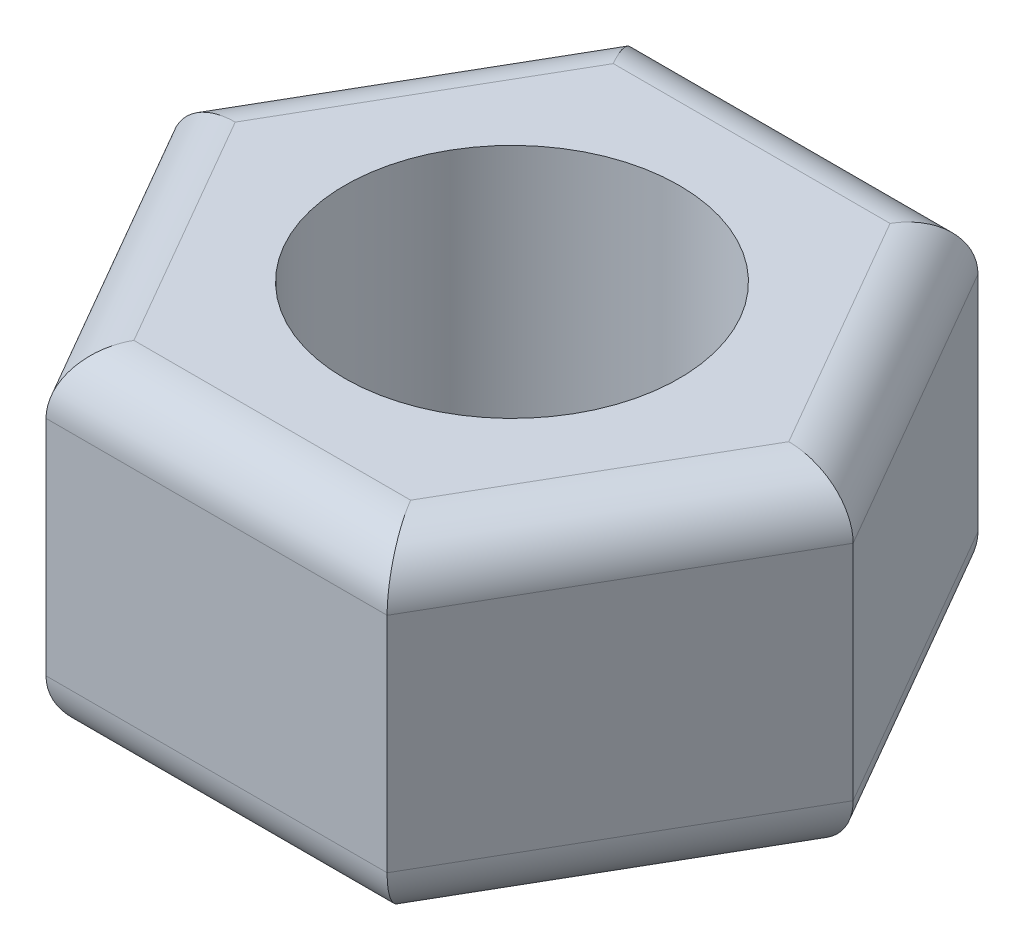
ISO-10303-21;
HEADER;
FILE_DESCRIPTION(('STEP AP214'),'2;1');
FILE_NAME('part.step','',(''),(''),'','','');
FILE_SCHEMA(('AUTOMOTIVE_DESIGN { 1 0 10303 214 1 1 1 1 }'));
ENDSEC;
DATA;
#1=APPLICATION_CONTEXT('core data for automotive mechanical design processes');
#2=APPLICATION_PROTOCOL_DEFINITION('international standard','automotive_design',2000,#1);
#3=PRODUCT_CONTEXT('',#1,'mechanical');
#4=PRODUCT('Part','Part','',(#3));
#5=PRODUCT_RELATED_PRODUCT_CATEGORY('part','',(#4));
#6=PRODUCT_DEFINITION_FORMATION('','',#4);
#7=PRODUCT_DEFINITION_CONTEXT('part definition',#1,'design');
#8=PRODUCT_DEFINITION('design','',#6,#7);
#9=PRODUCT_DEFINITION_SHAPE('','',#8);
#10=(LENGTH_UNIT() NAMED_UNIT(*) SI_UNIT(.MILLI.,.METRE.));
#11=(NAMED_UNIT(*) PLANE_ANGLE_UNIT() SI_UNIT($,.RADIAN.));
#12=(NAMED_UNIT(*) SI_UNIT($,.STERADIAN.) SOLID_ANGLE_UNIT());
#13=UNCERTAINTY_MEASURE_WITH_UNIT(LENGTH_MEASURE(1.E-05),#10,'distance_accuracy_value','');
#14=(GEOMETRIC_REPRESENTATION_CONTEXT(3) GLOBAL_UNCERTAINTY_ASSIGNED_CONTEXT((#13)) GLOBAL_UNIT_ASSIGNED_CONTEXT((#10,
#11,#12)) REPRESENTATION_CONTEXT('',''));
#15=CARTESIAN_POINT('',(0.,0.,0.));
#16=DIRECTION('',(0.,0.,1.));
#17=DIRECTION('',(1.,0.,0.));
#18=AXIS2_PLACEMENT_3D('',#15,#16,#17);
#19=CARTESIAN_POINT('',(1.52997821335252,3.,2.64999999999999));
#20=DIRECTION('',(-0.866025403784438,0.,-0.500000000000001));
#21=DIRECTION('',(-0.500000000000001,0.,0.866025403784438));
#22=AXIS2_PLACEMENT_3D('',#19,#20,#21);
#23=PLANE('',#22);
#24=DIRECTION('',(0.,-1.,0.));
#25=VECTOR('',#24,1.);
#26=CARTESIAN_POINT('',(1.52997821335252,3.,2.64999999999999));
#27=LINE('',#26,#25);
#28=CARTESIAN_POINT('',(1.52997821335252,2.5,2.64999999999999));
#29=VERTEX_POINT('',#28);
#30=CARTESIAN_POINT('',(1.52997821335252,0.5,2.64999999999999));
#31=VERTEX_POINT('',#30);
#32=EDGE_CURVE('E242',#29,#31,#27,.T.);
#33=ORIENTED_EDGE('',*,*,#32,.T.);
#34=DIRECTION('',(0.500000000000001,0.,-0.866025403784438));
#35=VECTOR('',#34,1.);
#36=CARTESIAN_POINT('',(1.52997821335252,0.5,2.64999999999999));
#37=LINE('',#36,#35);
#38=CARTESIAN_POINT('',(3.05995642670501,0.5,0.));
#39=VERTEX_POINT('',#38);
#40=EDGE_CURVE('E187',#31,#39,#37,.T.);
#41=ORIENTED_EDGE('',*,*,#40,.T.);
#42=DIRECTION('',(0.,-1.,0.));
#43=VECTOR('',#42,1.);
#44=CARTESIAN_POINT('',(3.05995642670501,3.,0.));
#45=LINE('',#44,#43);
#46=CARTESIAN_POINT('',(3.05995642670501,2.5,0.));
#47=VERTEX_POINT('',#46);
#48=EDGE_CURVE('E160',#47,#39,#45,.T.);
#49=ORIENTED_EDGE('',*,*,#48,.F.);
#50=DIRECTION('',(0.500000000000001,0.,-0.866025403784438));
#51=VECTOR('',#50,1.);
#52=CARTESIAN_POINT('',(1.52997821335252,2.5,2.64999999999999));
#53=LINE('',#52,#51);
#54=EDGE_CURVE('E185',#47,#29,#53,.F.);
#55=ORIENTED_EDGE('',*,*,#54,.T.);
#56=EDGE_LOOP('',(#33,#41,#49,#55));
#57=FACE_BOUND('',#56,.T.);
#58=ADVANCED_FACE('F35',(#57),#23,.F.);
#59=CARTESIAN_POINT('',(3.05995642670501,3.,0.));
#60=DIRECTION('',(-0.866025403784439,0.,0.499999999999999));
#61=DIRECTION('',(0.499999999999999,0.,0.866025403784439));
#62=AXIS2_PLACEMENT_3D('',#59,#60,#61);
#63=PLANE('',#62);
#64=ORIENTED_EDGE('',*,*,#48,.T.);
#65=DIRECTION('',(-0.499999999999999,0.,-0.866025403784439));
#66=VECTOR('',#65,1.);
#67=CARTESIAN_POINT('',(3.05995642670501,0.5,0.));
#68=LINE('',#67,#66);
#69=CARTESIAN_POINT('',(1.52997821335249,0.5,-2.65));
#70=VERTEX_POINT('',#69);
#71=EDGE_CURVE('E191',#39,#70,#68,.T.);
#72=ORIENTED_EDGE('',*,*,#71,.T.);
#73=DIRECTION('',(0.,-1.,0.));
#74=VECTOR('',#73,1.);
#75=CARTESIAN_POINT('',(1.52997821335249,3.,-2.65));
#76=LINE('',#75,#74);
#77=CARTESIAN_POINT('',(1.52997821335249,2.5,-2.65));
#78=VERTEX_POINT('',#77);
#79=EDGE_CURVE('E165',#78,#70,#76,.T.);
#80=ORIENTED_EDGE('',*,*,#79,.F.);
#81=DIRECTION('',(-0.499999999999999,0.,-0.866025403784439));
#82=VECTOR('',#81,1.);
#83=CARTESIAN_POINT('',(3.05995642670501,2.5,0.));
#84=LINE('',#83,#82);
#85=EDGE_CURVE('E189',#78,#47,#84,.F.);
#86=ORIENTED_EDGE('',*,*,#85,.T.);
#87=EDGE_LOOP('',(#64,#72,#80,#86));
#88=FACE_BOUND('',#87,.T.);
#89=ADVANCED_FACE('F285',(#88),#63,.F.);
#90=CARTESIAN_POINT('',(1.52997821335249,3.,-2.65));
#91=DIRECTION('',(0.,0.,1.));
#92=DIRECTION('',(1.,0.,0.));
#93=AXIS2_PLACEMENT_3D('',#90,#91,#92);
#94=PLANE('',#93);
#95=ORIENTED_EDGE('',*,*,#79,.T.);
#96=DIRECTION('',(-1.,0.,0.));
#97=VECTOR('',#96,1.);
#98=CARTESIAN_POINT('',(1.52997821335249,0.5,-2.65));
#99=LINE('',#98,#97);
#100=CARTESIAN_POINT('',(-1.52997821335251,0.5,-2.65));
#101=VERTEX_POINT('',#100);
#102=EDGE_CURVE('E196',#70,#101,#99,.T.);
#103=ORIENTED_EDGE('',*,*,#102,.T.);
#104=DIRECTION('',(0.,-1.,0.));
#105=VECTOR('',#104,1.);
#106=CARTESIAN_POINT('',(-1.52997821335251,3.,-2.65));
#107=LINE('',#106,#105);
#108=CARTESIAN_POINT('',(-1.52997821335251,2.5,-2.65));
#109=VERTEX_POINT('',#108);
#110=EDGE_CURVE('E149',#109,#101,#107,.T.);
#111=ORIENTED_EDGE('',*,*,#110,.F.);
#112=DIRECTION('',(-1.,0.,0.));
#113=VECTOR('',#112,1.);
#114=CARTESIAN_POINT('',(1.52997821335249,2.5,-2.65));
#115=LINE('',#114,#113);
#116=EDGE_CURVE('E193',#109,#78,#115,.F.);
#117=ORIENTED_EDGE('',*,*,#116,.T.);
#118=EDGE_LOOP('',(#95,#103,#111,#117));
#119=FACE_BOUND('',#118,.T.);
#120=ADVANCED_FACE('F256',(#119),#94,.F.);
#121=CARTESIAN_POINT('',(-1.52997821335251,3.,-2.65));
#122=DIRECTION('',(0.866025403784438,0.,0.500000000000001));
#123=DIRECTION('',(0.500000000000001,0.,-0.866025403784438));
#124=AXIS2_PLACEMENT_3D('',#121,#122,#123);
#125=PLANE('',#124);
#126=ORIENTED_EDGE('',*,*,#110,.T.);
#127=DIRECTION('',(-0.500000000000001,0.,0.866025403784438));
#128=VECTOR('',#127,1.);
#129=CARTESIAN_POINT('',(-1.52997821335251,0.5,-2.65));
#130=LINE('',#129,#128);
#131=CARTESIAN_POINT('',(-3.05995642670502,0.5,0.));
#132=VERTEX_POINT('',#131);
#133=EDGE_CURVE('E148',#101,#132,#130,.T.);
#134=ORIENTED_EDGE('',*,*,#133,.T.);
#135=DIRECTION('',(0.,-1.,0.));
#136=VECTOR('',#135,1.);
#137=CARTESIAN_POINT('',(-3.05995642670502,3.,0.));
#138=LINE('',#137,#136);
#139=CARTESIAN_POINT('',(-3.05995642670502,2.5,0.));
#140=VERTEX_POINT('',#139);
#141=EDGE_CURVE('E130',#140,#132,#138,.T.);
#142=ORIENTED_EDGE('',*,*,#141,.F.);
#143=DIRECTION('',(-0.500000000000001,0.,0.866025403784438));
#144=VECTOR('',#143,1.);
#145=CARTESIAN_POINT('',(-1.52997821335251,2.5,-2.65));
#146=LINE('',#145,#144);
#147=EDGE_CURVE('E145',#140,#109,#146,.F.);
#148=ORIENTED_EDGE('',*,*,#147,.T.);
#149=EDGE_LOOP('',(#126,#134,#142,#148));
#150=FACE_BOUND('',#149,.T.);
#151=ADVANCED_FACE('F143',(#150),#125,.F.);
#152=CARTESIAN_POINT('',(-3.05995642670502,3.,0.));
#153=DIRECTION('',(0.866025403784438,0.,-0.5));
#154=DIRECTION('',(-0.5,0.,-0.866025403784439));
#155=AXIS2_PLACEMENT_3D('',#152,#153,#154);
#156=PLANE('',#155);
#157=ORIENTED_EDGE('',*,*,#141,.T.);
#158=DIRECTION('',(0.5,0.,0.866025403784439));
#159=VECTOR('',#158,1.);
#160=CARTESIAN_POINT('',(-3.05995642670502,0.5,0.));
#161=LINE('',#160,#159);
#162=CARTESIAN_POINT('',(-1.52997821335251,0.5,2.65));
#163=VERTEX_POINT('',#162);
#164=EDGE_CURVE('E137',#132,#163,#161,.T.);
#165=ORIENTED_EDGE('',*,*,#164,.T.);
#166=DIRECTION('',(0.,-1.,0.));
#167=VECTOR('',#166,1.);
#168=CARTESIAN_POINT('',(-1.52997821335251,3.,2.65));
#169=LINE('',#168,#167);
#170=CARTESIAN_POINT('',(-1.52997821335251,2.5,2.65));
#171=VERTEX_POINT('',#170);
#172=EDGE_CURVE('E132',#171,#163,#169,.T.);
#173=ORIENTED_EDGE('',*,*,#172,.F.);
#174=DIRECTION('',(0.5,0.,0.866025403784439));
#175=VECTOR('',#174,1.);
#176=CARTESIAN_POINT('',(-3.05995642670503,2.5,0.));
#177=LINE('',#176,#175);
#178=EDGE_CURVE('E127',#171,#140,#177,.F.);
#179=ORIENTED_EDGE('',*,*,#178,.T.);
#180=EDGE_LOOP('',(#157,#165,#173,#179));
#181=FACE_BOUND('',#180,.T.);
#182=ADVANCED_FACE('F129',(#181),#156,.F.);
#183=CARTESIAN_POINT('',(-1.52997821335251,3.,2.65));
#184=DIRECTION('',(0.,0.,-1.));
#185=DIRECTION('',(-1.,0.,0.));
#186=AXIS2_PLACEMENT_3D('',#183,#184,#185);
#187=PLANE('',#186);
#188=ORIENTED_EDGE('',*,*,#172,.T.);
#189=DIRECTION('',(1.,0.,0.));
#190=VECTOR('',#189,1.);
#191=CARTESIAN_POINT('',(-1.52997821335251,0.5,2.65));
#192=LINE('',#191,#190);
#193=EDGE_CURVE('E183',#163,#31,#192,.T.);
#194=ORIENTED_EDGE('',*,*,#193,.T.);
#195=ORIENTED_EDGE('',*,*,#32,.F.);
#196=DIRECTION('',(1.,0.,0.));
#197=VECTOR('',#196,1.);
#198=CARTESIAN_POINT('',(-1.52997821335251,2.5,2.65));
#199=LINE('',#198,#197);
#200=EDGE_CURVE('E181',#29,#171,#199,.F.);
#201=ORIENTED_EDGE('',*,*,#200,.T.);
#202=EDGE_LOOP('',(#188,#194,#195,#201));
#203=FACE_BOUND('',#202,.T.);
#204=ADVANCED_FACE('F239',(#203),#187,.F.);
#205=CARTESIAN_POINT('',(0.,3.,0.));
#206=DIRECTION('',(0.,1.,0.));
#207=DIRECTION('',(0.,0.,1.));
#208=AXIS2_PLACEMENT_3D('',#205,#206,#207);
#209=PLANE('',#208);
#210=DIRECTION('',(-0.499999999999999,0.,-0.866025403784439));
#211=VECTOR('',#210,1.);
#212=CARTESIAN_POINT('',(1.09696551146027,3.,-2.4));
#213=LINE('',#212,#211);
#214=CARTESIAN_POINT('',(2.48260615751538,3.,0.));
#215=VERTEX_POINT('',#214);
#216=CARTESIAN_POINT('',(1.24130307875767,3.,-2.15));
#217=VERTEX_POINT('',#216);
#218=EDGE_CURVE('E198',#215,#217,#213,.T.);
#219=ORIENTED_EDGE('',*,*,#218,.T.);
#220=DIRECTION('',(-1.,0.,0.));
#221=VECTOR('',#220,1.);
#222=CARTESIAN_POINT('',(-1.52997821335251,3.,-2.15));
#223=LINE('',#222,#221);
#224=CARTESIAN_POINT('',(-1.2413030787577,3.,-2.15));
#225=VERTEX_POINT('',#224);
#226=EDGE_CURVE('E11',#217,#225,#223,.T.);
#227=ORIENTED_EDGE('',*,*,#226,.T.);
#228=DIRECTION('',(-0.500000000000001,0.,0.866025403784438));
#229=VECTOR('',#228,1.);
#230=CARTESIAN_POINT('',(-2.62694372481281,3.,0.249999999999995));
#231=LINE('',#230,#229);
#232=CARTESIAN_POINT('',(-2.4826061575154,3.,0.));
#233=VERTEX_POINT('',#232);
#234=EDGE_CURVE('E44',#225,#233,#231,.T.);
#235=ORIENTED_EDGE('',*,*,#234,.T.);
#236=DIRECTION('',(0.5,0.,0.866025403784439));
#237=VECTOR('',#236,1.);
#238=CARTESIAN_POINT('',(-1.09696551146029,3.,2.4));
#239=LINE('',#238,#237);
#240=CARTESIAN_POINT('',(-1.2413030787577,3.,2.15));
#241=VERTEX_POINT('',#240);
#242=EDGE_CURVE('E154',#233,#241,#239,.T.);
#243=ORIENTED_EDGE('',*,*,#242,.T.);
#244=DIRECTION('',(1.,0.,0.));
#245=VECTOR('',#244,1.);
#246=CARTESIAN_POINT('',(1.52997821335252,3.,2.14999999999999));
#247=LINE('',#246,#245);
#248=CARTESIAN_POINT('',(1.2413030787577,3.,2.14999999999999));
#249=VERTEX_POINT('',#248);
#250=EDGE_CURVE('E202',#241,#249,#247,.T.);
#251=ORIENTED_EDGE('',*,*,#250,.T.);
#252=DIRECTION('',(0.500000000000001,0.,-0.866025403784438));
#253=VECTOR('',#252,1.);
#254=CARTESIAN_POINT('',(2.62694372481279,3.,-0.249999999999972));
#255=LINE('',#254,#253);
#256=EDGE_CURVE('E200',#249,#215,#255,.T.);
#257=ORIENTED_EDGE('',*,*,#256,.T.);
#258=EDGE_LOOP('',(#219,#227,#235,#243,#251,#257));
#259=FACE_BOUND('',#258,.T.);
#260=CARTESIAN_POINT('',(0.,3.,0.));
#261=DIRECTION('',(0.,1.,0.));
#262=DIRECTION('',(0.,0.,1.));
#263=AXIS2_PLACEMENT_3D('',#260,#261,#262);
#264=CIRCLE('',#263,1.5);
#265=CARTESIAN_POINT('',(0.,3.,1.5));
#266=VERTEX_POINT('',#265);
#267=EDGE_CURVE('E222',#266,#266,#264,.T.);
#268=ORIENTED_EDGE('',*,*,#267,.F.);
#269=EDGE_LOOP('',(#268));
#270=FACE_BOUND('',#269,.T.);
#271=ADVANCED_FACE('F291',(#259,#270),#209,.T.);
#272=CARTESIAN_POINT('',(0.,0.,0.));
#273=DIRECTION('',(0.,1.,0.));
#274=DIRECTION('',(0.,0.,1.));
#275=AXIS2_PLACEMENT_3D('',#272,#273,#274);
#276=PLANE('',#275);
#277=DIRECTION('',(0.5,0.,0.866025403784439));
#278=VECTOR('',#277,1.);
#279=CARTESIAN_POINT('',(-1.86195461813655,0.,1.075));
#280=LINE('',#279,#278);
#281=CARTESIAN_POINT('',(-1.2413030787577,0.,2.15));
#282=VERTEX_POINT('',#281);
#283=CARTESIAN_POINT('',(-2.4826061575154,0.,0.));
#284=VERTEX_POINT('',#283);
#285=EDGE_CURVE('E176',#282,#284,#280,.F.);
#286=ORIENTED_EDGE('',*,*,#285,.T.);
#287=DIRECTION('',(-0.500000000000001,0.,0.866025403784438));
#288=VECTOR('',#287,1.);
#289=CARTESIAN_POINT('',(-1.86195461813655,0.,-1.07500000000001));
#290=LINE('',#289,#288);
#291=CARTESIAN_POINT('',(-1.2413030787577,0.,-2.15));
#292=VERTEX_POINT('',#291);
#293=EDGE_CURVE('E138',#284,#292,#290,.F.);
#294=ORIENTED_EDGE('',*,*,#293,.T.);
#295=DIRECTION('',(-1.,0.,0.));
#296=VECTOR('',#295,1.);
#297=CARTESIAN_POINT('',(0.,0.,-2.15));
#298=LINE('',#297,#296);
#299=CARTESIAN_POINT('',(1.24130307875767,0.,-2.15));
#300=VERTEX_POINT('',#299);
#301=EDGE_CURVE('E162',#292,#300,#298,.F.);
#302=ORIENTED_EDGE('',*,*,#301,.T.);
#303=DIRECTION('',(-0.499999999999999,0.,-0.866025403784439));
#304=VECTOR('',#303,1.);
#305=CARTESIAN_POINT('',(1.86195461813653,0.,-1.07499999999999));
#306=LINE('',#305,#304);
#307=CARTESIAN_POINT('',(2.48260615751538,0.,0.));
#308=VERTEX_POINT('',#307);
#309=EDGE_CURVE('E170',#300,#308,#306,.F.);
#310=ORIENTED_EDGE('',*,*,#309,.T.);
#311=DIRECTION('',(0.500000000000001,0.,-0.866025403784438));
#312=VECTOR('',#311,1.);
#313=CARTESIAN_POINT('',(1.86195461813655,0.,1.075));
#314=LINE('',#313,#312);
#315=CARTESIAN_POINT('',(1.2413030787577,0.,2.14999999999999));
#316=VERTEX_POINT('',#315);
#317=EDGE_CURVE('E172',#308,#316,#314,.F.);
#318=ORIENTED_EDGE('',*,*,#317,.T.);
#319=DIRECTION('',(1.,0.,0.));
#320=VECTOR('',#319,1.);
#321=CARTESIAN_POINT('',(0.,0.,2.15));
#322=LINE('',#321,#320);
#323=EDGE_CURVE('E174',#316,#282,#322,.F.);
#324=ORIENTED_EDGE('',*,*,#323,.T.);
#325=EDGE_LOOP('',(#286,#294,#302,#310,#318,#324));
#326=FACE_BOUND('',#325,.T.);
#327=CARTESIAN_POINT('',(0.,0.,0.));
#328=DIRECTION('',(0.,1.,0.));
#329=DIRECTION('',(0.,0.,1.));
#330=AXIS2_PLACEMENT_3D('',#327,#328,#329);
#331=CIRCLE('',#330,1.5);
#332=CARTESIAN_POINT('',(0.,0.,1.5));
#333=VERTEX_POINT('',#332);
#334=EDGE_CURVE('E245',#333,#333,#331,.T.);
#335=ORIENTED_EDGE('',*,*,#334,.T.);
#336=EDGE_LOOP('',(#335));
#337=FACE_BOUND('',#336,.T.);
#338=ADVANCED_FACE('F323',(#326,#337),#276,.F.);
#339=CARTESIAN_POINT('',(0.,0.,0.));
#340=DIRECTION('',(0.,1.,0.));
#341=DIRECTION('',(0.,0.,1.));
#342=AXIS2_PLACEMENT_3D('',#339,#340,#341);
#343=CYLINDRICAL_SURFACE('',#342,1.5);
#344=ORIENTED_EDGE('',*,*,#334,.F.);
#345=EDGE_LOOP('',(#344));
#346=FACE_BOUND('',#345,.T.);
#347=ORIENTED_EDGE('',*,*,#267,.T.);
#348=EDGE_LOOP('',(#347));
#349=FACE_BOUND('',#348,.T.);
#350=ADVANCED_FACE('F319',(#346,#349),#343,.F.);
#351=CARTESIAN_POINT('',(1.0969655114603,0.5,2.39999999999999));
#352=DIRECTION('',(0.500000000000001,0.,-0.866025403784438));
#353=DIRECTION('',(-0.866025403784438,0.,-0.500000000000001));
#354=AXIS2_PLACEMENT_3D('',#351,#352,#353);
#355=CYLINDRICAL_SURFACE('',#354,0.5);
#356=CARTESIAN_POINT('',(1.2413030787577,0.5,2.14999999999999));
#357=DIRECTION('',(0.866025403784438,0.,-0.500000000000001));
#358=DIRECTION('',(-0.500000000000001,0.,-0.866025403784438));
#359=AXIS2_PLACEMENT_3D('',#356,#357,#358);
#360=ELLIPSE('',#359,0.577350269189625,0.5);
#361=EDGE_CURVE('E216',#316,#31,#360,.F.);
#362=ORIENTED_EDGE('',*,*,#361,.F.);
#363=ORIENTED_EDGE('',*,*,#317,.F.);
#364=CARTESIAN_POINT('',(2.48260615751538,0.5,0.));
#365=DIRECTION('',(0.,0.,-1.));
#366=DIRECTION('',(-1.,0.,0.));
#367=AXIS2_PLACEMENT_3D('',#364,#365,#366);
#368=ELLIPSE('',#367,0.577350269189626,0.5);
#369=EDGE_CURVE('E219',#39,#308,#368,.T.);
#370=ORIENTED_EDGE('',*,*,#369,.F.);
#371=ORIENTED_EDGE('',*,*,#40,.F.);
#372=EDGE_LOOP('',(#362,#363,#370,#371));
#373=FACE_BOUND('',#372,.T.);
#374=ADVANCED_FACE('F282',(#373),#355,.T.);
#375=CARTESIAN_POINT('',(2.62694372481279,0.5,0.250000000000028));
#376=DIRECTION('',(-0.499999999999999,0.,-0.866025403784439));
#377=DIRECTION('',(-0.866025403784439,0.,0.499999999999999));
#378=AXIS2_PLACEMENT_3D('',#375,#376,#377);
#379=CYLINDRICAL_SURFACE('',#378,0.5);
#380=ORIENTED_EDGE('',*,*,#369,.T.);
#381=ORIENTED_EDGE('',*,*,#309,.F.);
#382=CARTESIAN_POINT('',(1.24130307875767,0.5,-2.15));
#383=DIRECTION('',(-0.866025403784438,0.,-0.500000000000001));
#384=DIRECTION('',(-0.500000000000001,0.,0.866025403784438));
#385=AXIS2_PLACEMENT_3D('',#382,#383,#384);
#386=ELLIPSE('',#385,0.577350269189626,0.5);
#387=EDGE_CURVE('E213',#70,#300,#386,.T.);
#388=ORIENTED_EDGE('',*,*,#387,.F.);
#389=ORIENTED_EDGE('',*,*,#71,.F.);
#390=EDGE_LOOP('',(#380,#381,#388,#389));
#391=FACE_BOUND('',#390,.T.);
#392=ADVANCED_FACE('F262',(#391),#379,.T.);
#393=CARTESIAN_POINT('',(-1.52997821335251,0.5,2.15));
#394=DIRECTION('',(1.,0.,0.));
#395=DIRECTION('',(0.,0.,-1.));
#396=AXIS2_PLACEMENT_3D('',#393,#394,#395);
#397=CYLINDRICAL_SURFACE('',#396,0.5);
#398=ORIENTED_EDGE('',*,*,#361,.T.);
#399=ORIENTED_EDGE('',*,*,#193,.F.);
#400=CARTESIAN_POINT('',(-1.2413030787577,0.5,2.15));
#401=DIRECTION('',(0.866025403784439,0.,0.499999999999999));
#402=DIRECTION('',(0.499999999999999,0.,-0.866025403784439));
#403=AXIS2_PLACEMENT_3D('',#400,#401,#402);
#404=ELLIPSE('',#403,0.577350269189626,0.5);
#405=EDGE_CURVE('E210',#282,#163,#404,.F.);
#406=ORIENTED_EDGE('',*,*,#405,.F.);
#407=ORIENTED_EDGE('',*,*,#323,.F.);
#408=EDGE_LOOP('',(#398,#399,#406,#407));
#409=FACE_BOUND('',#408,.T.);
#410=ADVANCED_FACE('F278',(#409),#397,.T.);
#411=CARTESIAN_POINT('',(1.52997821335249,0.5,-2.15));
#412=DIRECTION('',(-1.,0.,0.));
#413=DIRECTION('',(0.,0.,1.));
#414=AXIS2_PLACEMENT_3D('',#411,#412,#413);
#415=CYLINDRICAL_SURFACE('',#414,0.5);
#416=ORIENTED_EDGE('',*,*,#387,.T.);
#417=ORIENTED_EDGE('',*,*,#301,.F.);
#418=CARTESIAN_POINT('',(-1.2413030787577,0.5,-2.15));
#419=DIRECTION('',(-0.866025403784439,0.,0.5));
#420=DIRECTION('',(-0.5,0.,-0.866025403784439));
#421=AXIS2_PLACEMENT_3D('',#418,#419,#420);
#422=ELLIPSE('',#421,0.577350269189626,0.5);
#423=EDGE_CURVE('E208',#101,#292,#422,.T.);
#424=ORIENTED_EDGE('',*,*,#423,.F.);
#425=ORIENTED_EDGE('',*,*,#102,.F.);
#426=EDGE_LOOP('',(#416,#417,#424,#425));
#427=FACE_BOUND('',#426,.T.);
#428=ADVANCED_FACE('F266',(#427),#415,.T.);
#429=CARTESIAN_POINT('',(-2.62694372481281,0.5,-0.250000000000006));
#430=DIRECTION('',(0.5,0.,0.866025403784439));
#431=DIRECTION('',(0.866025403784439,0.,-0.5));
#432=AXIS2_PLACEMENT_3D('',#429,#430,#431);
#433=CYLINDRICAL_SURFACE('',#432,0.5);
#434=ORIENTED_EDGE('',*,*,#405,.T.);
#435=ORIENTED_EDGE('',*,*,#164,.F.);
#436=CARTESIAN_POINT('',(-2.4826061575154,0.5,0.));
#437=DIRECTION('',(0.,0.,1.));
#438=DIRECTION('',(1.,0.,0.));
#439=AXIS2_PLACEMENT_3D('',#436,#437,#438);
#440=ELLIPSE('',#439,0.577350269189626,0.5);
#441=EDGE_CURVE('E206',#284,#132,#440,.F.);
#442=ORIENTED_EDGE('',*,*,#441,.F.);
#443=ORIENTED_EDGE('',*,*,#285,.F.);
#444=EDGE_LOOP('',(#434,#435,#442,#443));
#445=FACE_BOUND('',#444,.T.);
#446=ADVANCED_FACE('F274',(#445),#433,.T.);
#447=CARTESIAN_POINT('',(-1.09696551146029,0.5,-2.4));
#448=DIRECTION('',(-0.500000000000001,0.,0.866025403784438));
#449=DIRECTION('',(0.866025403784438,0.,0.500000000000001));
#450=AXIS2_PLACEMENT_3D('',#447,#448,#449);
#451=CYLINDRICAL_SURFACE('',#450,0.5);
#452=ORIENTED_EDGE('',*,*,#423,.T.);
#453=ORIENTED_EDGE('',*,*,#293,.F.);
#454=ORIENTED_EDGE('',*,*,#441,.T.);
#455=ORIENTED_EDGE('',*,*,#133,.F.);
#456=EDGE_LOOP('',(#452,#453,#454,#455));
#457=FACE_BOUND('',#456,.T.);
#458=ADVANCED_FACE('F269',(#457),#451,.T.);
#459=CARTESIAN_POINT('',(0.,2.5,2.15));
#460=DIRECTION('',(-1.,0.,0.));
#461=DIRECTION('',(0.,0.,1.));
#462=AXIS2_PLACEMENT_3D('',#459,#460,#461);
#463=CYLINDRICAL_SURFACE('',#462,0.5);
#464=CARTESIAN_POINT('',(-1.2413030787577,2.5,2.15));
#465=DIRECTION('',(-0.866025403784439,0.,-0.499999999999999));
#466=DIRECTION('',(-0.499999999999999,0.,0.866025403784439));
#467=AXIS2_PLACEMENT_3D('',#464,#465,#466);
#468=ELLIPSE('',#467,0.577350269189626,0.5);
#469=EDGE_CURVE('E226',#171,#241,#468,.T.);
#470=ORIENTED_EDGE('',*,*,#469,.F.);
#471=ORIENTED_EDGE('',*,*,#200,.F.);
#472=CARTESIAN_POINT('',(1.2413030787577,2.5,2.14999999999999));
#473=DIRECTION('',(-0.866025403784438,0.,0.500000000000001));
#474=DIRECTION('',(0.500000000000001,0.,0.866025403784438));
#475=AXIS2_PLACEMENT_3D('',#472,#473,#474);
#476=ELLIPSE('',#475,0.577350269189625,0.5);
#477=EDGE_CURVE('E39',#249,#29,#476,.F.);
#478=ORIENTED_EDGE('',*,*,#477,.F.);
#479=ORIENTED_EDGE('',*,*,#250,.F.);
#480=EDGE_LOOP('',(#470,#471,#478,#479));
#481=FACE_BOUND('',#480,.T.);
#482=ADVANCED_FACE('F37',(#481),#463,.T.);
#483=CARTESIAN_POINT('',(1.86195461813655,2.5,1.075));
#484=DIRECTION('',(-0.500000000000001,0.,0.866025403784438));
#485=DIRECTION('',(0.866025403784438,0.,0.500000000000001));
#486=AXIS2_PLACEMENT_3D('',#483,#484,#485);
#487=CYLINDRICAL_SURFACE('',#486,0.5);
#488=ORIENTED_EDGE('',*,*,#477,.T.);
#489=ORIENTED_EDGE('',*,*,#54,.F.);
#490=CARTESIAN_POINT('',(2.48260615751538,2.5,0.));
#491=DIRECTION('',(0.,0.,1.));
#492=DIRECTION('',(1.,0.,0.));
#493=AXIS2_PLACEMENT_3D('',#490,#491,#492);
#494=ELLIPSE('',#493,0.577350269189626,0.5);
#495=EDGE_CURVE('E156',#215,#47,#494,.F.);
#496=ORIENTED_EDGE('',*,*,#495,.F.);
#497=ORIENTED_EDGE('',*,*,#256,.F.);
#498=EDGE_LOOP('',(#488,#489,#496,#497));
#499=FACE_BOUND('',#498,.T.);
#500=ADVANCED_FACE('F232',(#499),#487,.T.);
#501=CARTESIAN_POINT('',(-1.86195461813655,2.5,1.075));
#502=DIRECTION('',(-0.5,0.,-0.866025403784439));
#503=DIRECTION('',(-0.866025403784439,0.,0.5));
#504=AXIS2_PLACEMENT_3D('',#501,#502,#503);
#505=CYLINDRICAL_SURFACE('',#504,0.5);
#506=ORIENTED_EDGE('',*,*,#469,.T.);
#507=ORIENTED_EDGE('',*,*,#242,.F.);
#508=CARTESIAN_POINT('',(-2.4826061575154,2.5,0.));
#509=DIRECTION('',(0.,0.,-1.));
#510=DIRECTION('',(-1.,0.,0.));
#511=AXIS2_PLACEMENT_3D('',#508,#509,#510);
#512=ELLIPSE('',#511,0.577350269189626,0.5);
#513=EDGE_CURVE('E152',#140,#233,#512,.T.);
#514=ORIENTED_EDGE('',*,*,#513,.F.);
#515=ORIENTED_EDGE('',*,*,#178,.F.);
#516=EDGE_LOOP('',(#506,#507,#514,#515));
#517=FACE_BOUND('',#516,.T.);
#518=ADVANCED_FACE('F153',(#517),#505,.T.);
#519=CARTESIAN_POINT('',(1.86195461813653,2.5,-1.07499999999999));
#520=DIRECTION('',(0.499999999999999,0.,0.866025403784439));
#521=DIRECTION('',(0.866025403784439,0.,-0.499999999999999));
#522=AXIS2_PLACEMENT_3D('',#519,#520,#521);
#523=CYLINDRICAL_SURFACE('',#522,0.5);
#524=ORIENTED_EDGE('',*,*,#495,.T.);
#525=ORIENTED_EDGE('',*,*,#85,.F.);
#526=CARTESIAN_POINT('',(1.24130307875767,2.5,-2.15));
#527=DIRECTION('',(0.866025403784438,0.,0.500000000000001));
#528=DIRECTION('',(-0.500000000000001,0.,0.866025403784438));
#529=AXIS2_PLACEMENT_3D('',#526,#527,#528);
#530=ELLIPSE('',#529,0.577350269189626,0.5);
#531=EDGE_CURVE('E157',#217,#78,#530,.F.);
#532=ORIENTED_EDGE('',*,*,#531,.F.);
#533=ORIENTED_EDGE('',*,*,#218,.F.);
#534=EDGE_LOOP('',(#524,#525,#532,#533));
#535=FACE_BOUND('',#534,.T.);
#536=ADVANCED_FACE('F289',(#535),#523,.T.);
#537=CARTESIAN_POINT('',(-1.86195461813655,2.5,-1.07500000000001));
#538=DIRECTION('',(0.500000000000001,0.,-0.866025403784438));
#539=DIRECTION('',(-0.866025403784438,0.,-0.500000000000001));
#540=AXIS2_PLACEMENT_3D('',#537,#538,#539);
#541=CYLINDRICAL_SURFACE('',#540,0.5);
#542=ORIENTED_EDGE('',*,*,#513,.T.);
#543=ORIENTED_EDGE('',*,*,#234,.F.);
#544=CARTESIAN_POINT('',(-1.2413030787577,2.5,-2.15));
#545=DIRECTION('',(0.866025403784439,0.,-0.5));
#546=DIRECTION('',(-0.5,0.,-0.866025403784439));
#547=AXIS2_PLACEMENT_3D('',#544,#545,#546);
#548=ELLIPSE('',#547,0.577350269189626,0.5);
#549=EDGE_CURVE('E52',#109,#225,#548,.T.);
#550=ORIENTED_EDGE('',*,*,#549,.F.);
#551=ORIENTED_EDGE('',*,*,#147,.F.);
#552=EDGE_LOOP('',(#542,#543,#550,#551));
#553=FACE_BOUND('',#552,.T.);
#554=ADVANCED_FACE('F159',(#553),#541,.T.);
#555=CARTESIAN_POINT('',(0.,2.5,-2.15));
#556=DIRECTION('',(1.,0.,0.));
#557=DIRECTION('',(0.,0.,-1.));
#558=AXIS2_PLACEMENT_3D('',#555,#556,#557);
#559=CYLINDRICAL_SURFACE('',#558,0.5);
#560=ORIENTED_EDGE('',*,*,#531,.T.);
#561=ORIENTED_EDGE('',*,*,#116,.F.);
#562=ORIENTED_EDGE('',*,*,#549,.T.);
#563=ORIENTED_EDGE('',*,*,#226,.F.);
#564=EDGE_LOOP('',(#560,#561,#562,#563));
#565=FACE_BOUND('',#564,.T.);
#566=ADVANCED_FACE('F293',(#565),#559,.T.);
#567=CLOSED_SHELL('',(#58,#89,#120,#151,#182,#204,#271,#338,#350,#374,#392,#410,#428,#446,#458,
#482,#500,#518,#536,#554,#566));
#568=MANIFOLD_SOLID_BREP('B2',#567);
#569=ADVANCED_BREP_SHAPE_REPRESENTATION('',(#18,#568),#14);
#570=SHAPE_DEFINITION_REPRESENTATION(#9,#569);
ENDSEC;
END-ISO-10303-21;
